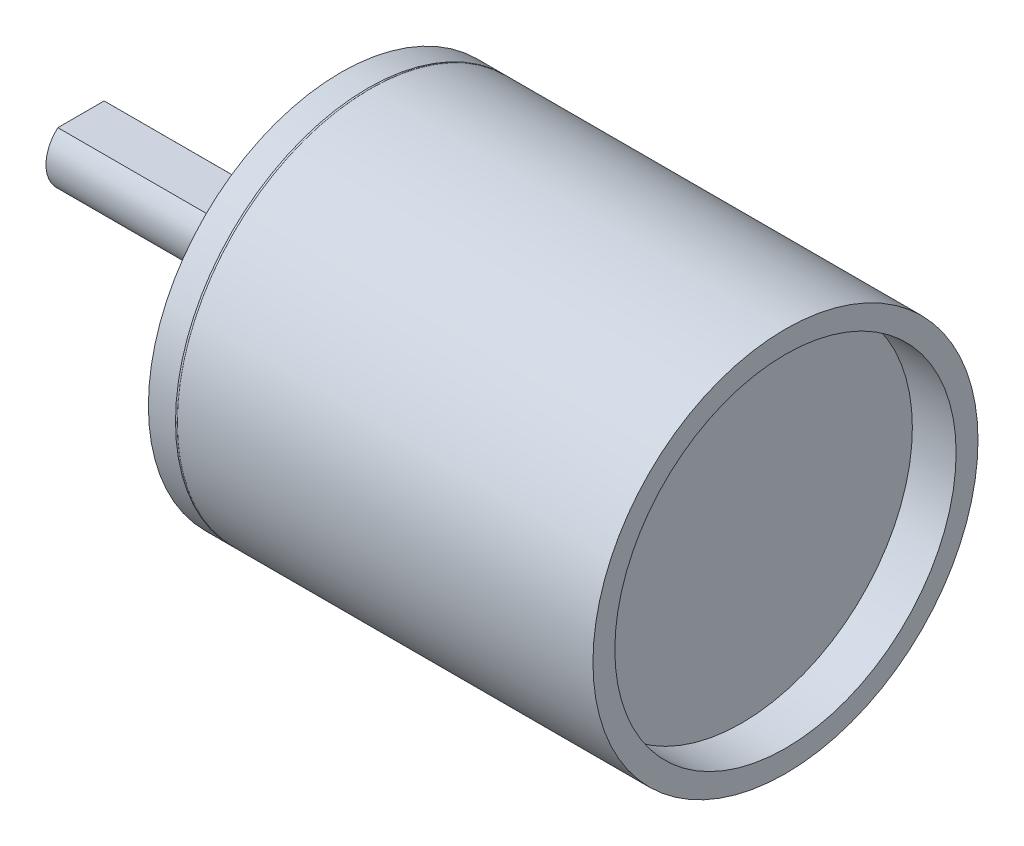
ISO-10303-21;
HEADER;
FILE_DESCRIPTION(('STEP AP214'),'2;1');
FILE_NAME('part.step','',(''),(''),'','','');
FILE_SCHEMA(('AUTOMOTIVE_DESIGN { 1 0 10303 214 1 1 1 1 }'));
ENDSEC;
DATA;
#1=APPLICATION_CONTEXT('core data for automotive mechanical design processes');
#2=APPLICATION_PROTOCOL_DEFINITION('international standard','automotive_design',2000,#1);
#3=PRODUCT_CONTEXT('',#1,'mechanical');
#4=PRODUCT('Part','Part','',(#3));
#5=PRODUCT_RELATED_PRODUCT_CATEGORY('part','',(#4));
#6=PRODUCT_DEFINITION_FORMATION('','',#4);
#7=PRODUCT_DEFINITION_CONTEXT('part definition',#1,'design');
#8=PRODUCT_DEFINITION('design','',#6,#7);
#9=PRODUCT_DEFINITION_SHAPE('','',#8);
#10=(LENGTH_UNIT() NAMED_UNIT(*) SI_UNIT(.MILLI.,.METRE.));
#11=(NAMED_UNIT(*) PLANE_ANGLE_UNIT() SI_UNIT($,.RADIAN.));
#12=(NAMED_UNIT(*) SI_UNIT($,.STERADIAN.) SOLID_ANGLE_UNIT());
#13=UNCERTAINTY_MEASURE_WITH_UNIT(LENGTH_MEASURE(1.E-05),#10,'distance_accuracy_value','');
#14=(GEOMETRIC_REPRESENTATION_CONTEXT(3) GLOBAL_UNCERTAINTY_ASSIGNED_CONTEXT((#13)) GLOBAL_UNIT_ASSIGNED_CONTEXT((#10,
#11,#12)) REPRESENTATION_CONTEXT('',''));
#15=CARTESIAN_POINT('',(0.,0.,0.));
#16=DIRECTION('',(0.,0.,1.));
#17=DIRECTION('',(1.,0.,0.));
#18=AXIS2_PLACEMENT_3D('',#15,#16,#17);
#19=CARTESIAN_POINT('',(-5.304325681522,1.750000002747,0.));
#20=DIRECTION('',(0.713250449154662,-0.700909264299362,0.));
#21=DIRECTION('',(0.700909264299362,0.713250449154662,0.));
#22=AXIS2_PLACEMENT_3D('',#19,#20,#21);
#23=PLANE('',#22);
#24=DIRECTION('',(0.,0.,1.));
#25=VECTOR('',#24,1.);
#26=CARTESIAN_POINT('',(-5.55,1.5,0.));
#27=LINE('',#26,#25);
#28=CARTESIAN_POINT('',(-5.54999999999996,1.50000000000007,1.3228756555322));
#29=VERTEX_POINT('',#28);
#30=CARTESIAN_POINT('',(-5.54999999999996,1.50000000000007,-1.3228756555322));
#31=VERTEX_POINT('',#30);
#32=EDGE_CURVE('P0_E70',#29,#31,#27,.F.);
#33=ORIENTED_EDGE('',*,*,#32,.F.);
#34=CARTESIAN_POINT('',(-7.02404589467157,0.,0.));
#35=DIRECTION('',(0.713250449154662,-0.700909264299362,0.));
#36=DIRECTION('',(0.700909264299362,0.713250449154662,0.));
#37=AXIS2_PLACEMENT_3D('',#34,#35,#36);
#38=ELLIPSE('',#37,2.80406412974627,2.);
#39=EDGE_CURVE('P0_E19',#31,#29,#38,.T.);
#40=ORIENTED_EDGE('',*,*,#39,.F.);
#41=EDGE_LOOP('',(#33,#40));
#42=FACE_BOUND('',#41,.T.);
#43=ADVANCED_FACE('P0_F16',(#42),#23,.F.);
#44=CARTESIAN_POINT('',(-14.85,-0.25,1.684082062692E-07));
#45=DIRECTION('',(1.,0.,0.));
#46=DIRECTION('',(0.,0.,-1.));
#47=AXIS2_PLACEMENT_3D('',#44,#45,#46);
#48=PLANE('',#47);
#49=CARTESIAN_POINT('',(-14.85,0.,0.));
#50=DIRECTION('',(1.,0.,0.));
#51=DIRECTION('',(0.,0.,-1.));
#52=AXIS2_PLACEMENT_3D('',#49,#50,#51);
#53=CIRCLE('',#52,2.);
#54=CARTESIAN_POINT('',(-14.85,1.50000000000007,1.32287565553221));
#55=VERTEX_POINT('',#54);
#56=CARTESIAN_POINT('',(-14.85,1.50000000000007,-1.32287565553221));
#57=VERTEX_POINT('',#56);
#58=EDGE_CURVE('P0_E59',#55,#57,#53,.T.);
#59=ORIENTED_EDGE('',*,*,#58,.F.);
#60=DIRECTION('',(0.,0.,1.));
#61=VECTOR('',#60,1.);
#62=CARTESIAN_POINT('',(-14.85,1.5,0.));
#63=LINE('',#62,#61);
#64=EDGE_CURVE('P0_E62',#57,#55,#63,.T.);
#65=ORIENTED_EDGE('',*,*,#64,.F.);
#66=EDGE_LOOP('',(#59,#65));
#67=FACE_BOUND('',#66,.T.);
#68=ADVANCED_FACE('P0_F61',(#67),#48,.F.);
#69=CARTESIAN_POINT('',(-10.2,1.5,0.));
#70=DIRECTION('',(0.,1.,0.));
#71=DIRECTION('',(0.,0.,1.));
#72=AXIS2_PLACEMENT_3D('',#69,#70,#71);
#73=PLANE('',#72);
#74=ORIENTED_EDGE('',*,*,#64,.T.);
#75=DIRECTION('',(1.,0.,0.));
#76=VECTOR('',#75,1.);
#77=CARTESIAN_POINT('',(-14.85,1.50000000000015,1.32287565553213));
#78=LINE('',#77,#76);
#79=EDGE_CURVE('P0_E69',#29,#55,#78,.F.);
#80=ORIENTED_EDGE('',*,*,#79,.F.);
#81=ORIENTED_EDGE('',*,*,#32,.T.);
#82=DIRECTION('',(1.,0.,0.));
#83=VECTOR('',#82,1.);
#84=CARTESIAN_POINT('',(-14.85,1.50000000000015,-1.32287565553213));
#85=LINE('',#84,#83);
#86=EDGE_CURVE('P0_E64',#57,#31,#85,.T.);
#87=ORIENTED_EDGE('',*,*,#86,.F.);
#88=EDGE_LOOP('',(#74,#80,#81,#87));
#89=FACE_BOUND('',#88,.T.);
#90=ADVANCED_FACE('P0_F67',(#89),#73,.T.);
#91=CARTESIAN_POINT('',(-14.85,0.,0.));
#92=DIRECTION('',(1.,0.,0.));
#93=DIRECTION('',(0.,0.,-1.));
#94=AXIS2_PLACEMENT_3D('',#91,#92,#93);
#95=CYLINDRICAL_SURFACE('',#94,2.);
#96=CARTESIAN_POINT('',(-3.15,0.,0.));
#97=DIRECTION('',(1.,0.,0.));
#98=DIRECTION('',(0.,0.,-1.));
#99=AXIS2_PLACEMENT_3D('',#96,#97,#98);
#100=CIRCLE('',#99,2.);
#101=CARTESIAN_POINT('',(-3.15,0.,-2.));
#102=VERTEX_POINT('',#101);
#103=EDGE_CURVE('P0_E114',#102,#102,#100,.F.);
#104=ORIENTED_EDGE('',*,*,#103,.T.);
#105=EDGE_LOOP('',(#104));
#106=FACE_BOUND('',#105,.T.);
#107=ORIENTED_EDGE('',*,*,#58,.T.);
#108=ORIENTED_EDGE('',*,*,#86,.T.);
#109=ORIENTED_EDGE('',*,*,#39,.T.);
#110=ORIENTED_EDGE('',*,*,#79,.T.);
#111=EDGE_LOOP('',(#107,#108,#109,#110));
#112=FACE_BOUND('',#111,.T.);
#113=ADVANCED_FACE('P0_F72',(#106,#112),#95,.T.);
#114=CARTESIAN_POINT('',(-3.15,0.,0.));
#115=DIRECTION('',(1.,0.,0.));
#116=DIRECTION('',(0.,0.,-1.));
#117=AXIS2_PLACEMENT_3D('',#114,#115,#116);
#118=PLANE('',#117);
#119=ORIENTED_EDGE('',*,*,#103,.F.);
#120=EDGE_LOOP('',(#119));
#121=FACE_BOUND('',#120,.T.);
#122=CARTESIAN_POINT('',(-3.15,0.,0.));
#123=DIRECTION('',(1.,0.,0.));
#124=DIRECTION('',(0.,0.,-1.));
#125=AXIS2_PLACEMENT_3D('',#122,#123,#124);
#126=CIRCLE('',#125,3.5);
#127=CARTESIAN_POINT('',(-3.15,0.,-3.5));
#128=VERTEX_POINT('',#127);
#129=EDGE_CURVE('P0_E111',#128,#128,#126,.T.);
#130=ORIENTED_EDGE('',*,*,#129,.F.);
#131=EDGE_LOOP('',(#130));
#132=FACE_BOUND('',#131,.T.);
#133=ADVANCED_FACE('P0_F119',(#121,#132),#118,.F.);
#134=CARTESIAN_POINT('',(-3.15,0.,0.));
#135=DIRECTION('',(1.,0.,0.));
#136=DIRECTION('',(0.,0.,-1.));
#137=AXIS2_PLACEMENT_3D('',#134,#135,#136);
#138=CYLINDRICAL_SURFACE('',#137,3.5);
#139=ORIENTED_EDGE('',*,*,#129,.T.);
#140=EDGE_LOOP('',(#139));
#141=FACE_BOUND('',#140,.T.);
#142=CARTESIAN_POINT('',(-1.35,0.,0.));
#143=DIRECTION('',(1.,0.,0.));
#144=DIRECTION('',(0.,0.,-1.));
#145=AXIS2_PLACEMENT_3D('',#142,#143,#144);
#146=CIRCLE('',#145,3.5);
#147=CARTESIAN_POINT('',(-1.35,0.,-3.5));
#148=VERTEX_POINT('',#147);
#149=EDGE_CURVE('P0_E108',#148,#148,#146,.F.);
#150=ORIENTED_EDGE('',*,*,#149,.T.);
#151=EDGE_LOOP('',(#150));
#152=FACE_BOUND('',#151,.T.);
#153=ADVANCED_FACE('P0_F122',(#141,#152),#138,.T.);
#154=CARTESIAN_POINT('',(-1.35,0.,0.));
#155=DIRECTION('',(1.,0.,0.));
#156=DIRECTION('',(0.,0.,-1.));
#157=AXIS2_PLACEMENT_3D('',#154,#155,#156);
#158=PLANE('',#157);
#159=ORIENTED_EDGE('',*,*,#149,.F.);
#160=EDGE_LOOP('',(#159));
#161=FACE_BOUND('',#160,.T.);
#162=CARTESIAN_POINT('',(-1.35,0.,0.));
#163=DIRECTION('',(1.,0.,0.));
#164=DIRECTION('',(0.,0.,-1.));
#165=AXIS2_PLACEMENT_3D('',#162,#163,#164);
#166=CIRCLE('',#165,5.);
#167=CARTESIAN_POINT('',(-1.35,0.,-5.));
#168=VERTEX_POINT('',#167);
#169=EDGE_CURVE('P0_E103',#168,#168,#166,.T.);
#170=ORIENTED_EDGE('',*,*,#169,.F.);
#171=EDGE_LOOP('',(#170));
#172=FACE_BOUND('',#171,.T.);
#173=ADVANCED_FACE('P0_F128',(#161,#172),#158,.F.);
#174=CARTESIAN_POINT('',(4.0000000000191,6.999999999989,1.221730476395E-05));
#175=DIRECTION('',(-1.,0.,0.));
#176=DIRECTION('',(0.,0.,1.));
#177=AXIS2_PLACEMENT_3D('',#174,#175,#176);
#178=CONICAL_SURFACE('',#177,1.02499999981555,1.02974425851489);
#179=CARTESIAN_POINT('',(4.,6.999999999989,1.221730476395E-05));
#180=DIRECTION('',(-1.,0.,0.));
#181=DIRECTION('',(0.,0.,1.));
#182=AXIS2_PLACEMENT_3D('',#179,#180,#181);
#183=CIRCLE('',#182,1.025);
#184=CARTESIAN_POINT('',(4.,6.999999999989,1.02501221730476));
#185=VERTEX_POINT('',#184);
#186=EDGE_CURVE('P0_E106',#185,#185,#183,.T.);
#187=ORIENTED_EDGE('',*,*,#186,.T.);
#188=EDGE_LOOP('',(#187));
#189=FACE_BOUND('',#188,.T.);
#190=CARTESIAN_POINT('',(4.61588213448749,7.00000000006185,1.221730476395E-05));
#191=VERTEX_POINT('',#190);
#192=VERTEX_LOOP('',#191);
#193=FACE_BOUND('',#192,.T.);
#194=ADVANCED_FACE('P0_F134',(#189,#193),#178,.F.);
#195=CARTESIAN_POINT('',(3.99999999996226,-3.500010580491,6.062171717829));
#196=DIRECTION('',(-1.,0.,0.));
#197=DIRECTION('',(0.,0.,1.));
#198=AXIS2_PLACEMENT_3D('',#195,#196,#197);
#199=CONICAL_SURFACE('',#198,1.02499999994784,1.02974425865799);
#200=CARTESIAN_POINT('',(3.99999999990541,-2.98751058050285,5.17449567897052));
#201=CARTESIAN_POINT('',(4.02566175549754,-3.00886473888174,5.21148218541788));
#202=CARTESIAN_POINT('',(4.05132351111989,-3.03021889832285,5.24846869123101));
#203=CARTESIAN_POINT('',(4.1026470223646,-3.07292721927441,5.32244170162462));
#204=CARTESIAN_POINT('',(4.12830877798695,-3.09428138078487,5.35942820620511));
#205=CARTESIAN_POINT('',(4.17963228919821,-3.13698970584252,5.43340121420825));
#206=CARTESIAN_POINT('',(4.20529404478713,-3.15834386938971,5.47038771763089));
#207=CARTESIAN_POINT('',(4.25661755597447,-3.20105219856139,5.54436072327025));
#208=CARTESIAN_POINT('',(4.2822793115729,-3.22240636418587,5.58134722548696));
#209=CARTESIAN_POINT('',(4.33360282277961,-3.26511469751708,5.65532022875441));
#210=CARTESIAN_POINT('',(4.35926457838788,-3.2864688652238,5.69230672980515));
#211=CARTESIAN_POINT('',(4.41058808962184,-3.32917720272132,5.76627973065341));
#212=CARTESIAN_POINT('',(4.43624984524753,-3.35053137251211,5.80326623045093));
#213=CARTESIAN_POINT('',(4.48757335646287,-3.39323971412742,5.87723922889167));
#214=CARTESIAN_POINT('',(4.51323511205252,-3.41459388595195,5.91422572753488));
#215=CARTESIAN_POINT('',(4.56455862325077,-3.45730223168929,5.98819872364552));
#216=CARTESIAN_POINT('',(4.59022037885936,-3.4786564056021,6.02518522111294));
#217=CARTESIAN_POINT('',(4.61588213448749,-3.50001058057184,6.0621717179566));
#218=B_SPLINE_CURVE_WITH_KNOTS('',3,(#200,#201,#202,#203,#204,#205,#206,#207,#208,#209,#210,
#211,#212,#213,#214,#215,#216,#217),.UNSPECIFIED.,.F.,.F.,(4,2,2,2,2,2,2,2,4),(0.,
0.149474904093955,0.298949808103517,0.448424712101636,0.597899616099755,0.747374520193708,
0.896849424203269,1.04632432820139,1.19579923229534),.UNSPECIFIED.);
#219=CARTESIAN_POINT('',(3.99999999997635,-2.98751058049379,5.17449567895433));
#220=VERTEX_POINT('',#219);
#221=CARTESIAN_POINT('',(4.61588213448749,-3.500010580491,6.062171717829));
#222=VERTEX_POINT('',#221);
#223=EDGE_CURVE('P0_E107',#220,#222,#218,.T.);
#224=ORIENTED_EDGE('',*,*,#223,.T.);
#225=DIRECTION('',(0.515038074909772,0.428583650350787,-0.742328657701715));
#226=VECTOR('',#225,1.);
#227=CARTESIAN_POINT('',(-346204.404158143,-288097.784339413,499000.));
#228=LINE('',#227,#226);
#229=CARTESIAN_POINT('',(3.99999999999056,-4.01251058047455,6.94984775668915));
#230=VERTEX_POINT('',#229);
#231=EDGE_CURVE('P0_E34',#222,#230,#228,.F.);
#232=ORIENTED_EDGE('',*,*,#231,.T.);
#233=CARTESIAN_POINT('',(4.,-3.500010580491,6.062171717829));
#234=DIRECTION('',(-1.,0.,0.));
#235=DIRECTION('',(0.,0.,1.));
#236=AXIS2_PLACEMENT_3D('',#233,#234,#235);
#237=CIRCLE('',#236,1.025000000001);
#238=EDGE_CURVE('P0_E169',#230,#220,#237,.T.);
#239=ORIENTED_EDGE('',*,*,#238,.T.);
#240=EDGE_LOOP('',(#224,#232,#239));
#241=FACE_BOUND('',#240,.T.);
#242=ADVANCED_FACE('P0_F250',(#241),#199,.F.);
#243=CARTESIAN_POINT('',(3.99999999996226,-3.500010580491,6.062171717829));
#244=DIRECTION('',(-1.,0.,0.));
#245=DIRECTION('',(0.,0.,1.));
#246=AXIS2_PLACEMENT_3D('',#243,#244,#245);
#247=CONICAL_SURFACE('',#246,1.02499999989861,1.02974425855217);
#248=CARTESIAN_POINT('',(4.,-3.500010580491,6.062171717829));
#249=DIRECTION('',(-1.,0.,0.));
#250=DIRECTION('',(0.,0.,1.));
#251=AXIS2_PLACEMENT_3D('',#248,#249,#250);
#252=CIRCLE('',#251,1.025000000001);
#253=EDGE_CURVE('P0_E168',#220,#230,#252,.T.);
#254=ORIENTED_EDGE('',*,*,#253,.T.);
#255=ORIENTED_EDGE('',*,*,#231,.F.);
#256=ORIENTED_EDGE('',*,*,#223,.F.);
#257=EDGE_LOOP('',(#254,#255,#256));
#258=FACE_BOUND('',#257,.T.);
#259=ADVANCED_FACE('P0_F183',(#258),#247,.F.);
#260=CARTESIAN_POINT('',(3.99999999996226,-3.499989419498,-6.062183935134));
#261=DIRECTION('',(-1.,0.,0.));
#262=DIRECTION('',(0.,0.,1.));
#263=AXIS2_PLACEMENT_3D('',#260,#261,#262);
#264=CONICAL_SURFACE('',#263,1.02500000002402,1.02974425869443);
#265=CARTESIAN_POINT('',(4.,-3.499989419498,-6.062183935134));
#266=DIRECTION('',(-1.,0.,0.));
#267=DIRECTION('',(0.,0.,1.));
#268=AXIS2_PLACEMENT_3D('',#265,#266,#267);
#269=CIRCLE('',#268,1.025);
#270=CARTESIAN_POINT('',(4.,-3.499989419498,-5.037183935134));
#271=VERTEX_POINT('',#270);
#272=EDGE_CURVE('P0_E102',#271,#271,#269,.T.);
#273=ORIENTED_EDGE('',*,*,#272,.T.);
#274=EDGE_LOOP('',(#273));
#275=FACE_BOUND('',#274,.T.);
#276=CARTESIAN_POINT('',(4.61588213443065,-3.499989419498,-6.062183935134));
#277=VERTEX_POINT('',#276);
#278=VERTEX_LOOP('',#277);
#279=FACE_BOUND('',#278,.T.);
#280=ADVANCED_FACE('P0_F142',(#275,#279),#264,.F.);
#281=CARTESIAN_POINT('',(-1.35,0.,0.));
#282=DIRECTION('',(1.,0.,0.));
#283=DIRECTION('',(0.,0.,-1.));
#284=AXIS2_PLACEMENT_3D('',#281,#282,#283);
#285=CYLINDRICAL_SURFACE('',#284,5.);
#286=ORIENTED_EDGE('',*,*,#169,.T.);
#287=EDGE_LOOP('',(#286));
#288=FACE_BOUND('',#287,.T.);
#289=CARTESIAN_POINT('',(0.,0.,0.));
#290=DIRECTION('',(1.,0.,0.));
#291=DIRECTION('',(0.,0.,-1.));
#292=AXIS2_PLACEMENT_3D('',#289,#290,#291);
#293=CIRCLE('',#292,5.);
#294=CARTESIAN_POINT('',(0.,0.,-5.));
#295=VERTEX_POINT('',#294);
#296=EDGE_CURVE('P0_E99',#295,#295,#293,.F.);
#297=ORIENTED_EDGE('',*,*,#296,.T.);
#298=EDGE_LOOP('',(#297));
#299=FACE_BOUND('',#298,.T.);
#300=ADVANCED_FACE('P0_F138',(#288,#299),#285,.T.);
#301=CARTESIAN_POINT('',(4.,6.999999999989,1.221730476395E-05));
#302=DIRECTION('',(-1.,0.,0.));
#303=DIRECTION('',(0.,0.,1.));
#304=AXIS2_PLACEMENT_3D('',#301,#302,#303);
#305=CYLINDRICAL_SURFACE('',#304,1.025);
#306=ORIENTED_EDGE('',*,*,#186,.F.);
#307=EDGE_LOOP('',(#306));
#308=FACE_BOUND('',#307,.T.);
#309=CARTESIAN_POINT('',(0.,6.999999999989,1.221730476395E-05));
#310=DIRECTION('',(-1.,0.,0.));
#311=DIRECTION('',(0.,0.,1.));
#312=AXIS2_PLACEMENT_3D('',#309,#310,#311);
#313=CIRCLE('',#312,1.025);
#314=CARTESIAN_POINT('',(0.,6.999999999989,1.02501221730476));
#315=VERTEX_POINT('',#314);
#316=EDGE_CURVE('P0_E96',#315,#315,#313,.T.);
#317=ORIENTED_EDGE('',*,*,#316,.T.);
#318=EDGE_LOOP('',(#317));
#319=FACE_BOUND('',#318,.T.);
#320=ADVANCED_FACE('P0_F141',(#308,#319),#305,.F.);
#321=CARTESIAN_POINT('',(4.,-3.500010580491,6.062171717829));
#322=DIRECTION('',(-1.,0.,0.));
#323=DIRECTION('',(0.,0.,1.));
#324=AXIS2_PLACEMENT_3D('',#321,#322,#323);
#325=CYLINDRICAL_SURFACE('',#324,1.025000000001);
#326=ORIENTED_EDGE('',*,*,#253,.F.);
#327=ORIENTED_EDGE('',*,*,#238,.F.);
#328=EDGE_LOOP('',(#326,#327));
#329=FACE_BOUND('',#328,.T.);
#330=CARTESIAN_POINT('',(0.,-3.500010580491,6.062171717829));
#331=DIRECTION('',(-1.,0.,0.));
#332=DIRECTION('',(0.,0.,1.));
#333=AXIS2_PLACEMENT_3D('',#330,#331,#332);
#334=CIRCLE('',#333,1.025000000001);
#335=CARTESIAN_POINT('',(0.,-3.500010580491,7.08717171783));
#336=VERTEX_POINT('',#335);
#337=EDGE_CURVE('P0_E93',#336,#336,#334,.T.);
#338=ORIENTED_EDGE('',*,*,#337,.T.);
#339=EDGE_LOOP('',(#338));
#340=FACE_BOUND('',#339,.T.);
#341=ADVANCED_FACE('P0_F201',(#329,#340),#325,.F.);
#342=CARTESIAN_POINT('',(4.,-3.499989419498,-6.062183935134));
#343=DIRECTION('',(-1.,0.,0.));
#344=DIRECTION('',(0.,0.,1.));
#345=AXIS2_PLACEMENT_3D('',#342,#343,#344);
#346=CYLINDRICAL_SURFACE('',#345,1.025);
#347=ORIENTED_EDGE('',*,*,#272,.F.);
#348=EDGE_LOOP('',(#347));
#349=FACE_BOUND('',#348,.T.);
#350=CARTESIAN_POINT('',(0.,-3.499989419498,-6.062183935134));
#351=DIRECTION('',(-1.,0.,0.));
#352=DIRECTION('',(0.,0.,1.));
#353=AXIS2_PLACEMENT_3D('',#350,#351,#352);
#354=CIRCLE('',#353,1.025);
#355=CARTESIAN_POINT('',(0.,-3.499989419498,-5.037183935134));
#356=VERTEX_POINT('',#355);
#357=EDGE_CURVE('P0_E90',#356,#356,#354,.T.);
#358=ORIENTED_EDGE('',*,*,#357,.T.);
#359=EDGE_LOOP('',(#358));
#360=FACE_BOUND('',#359,.T.);
#361=ADVANCED_FACE('P0_F209',(#349,#360),#346,.F.);
#362=CARTESIAN_POINT('',(22.9,0.,0.));
#363=DIRECTION('',(1.,0.,0.));
#364=DIRECTION('',(0.,0.,-1.));
#365=AXIS2_PLACEMENT_3D('',#362,#363,#364);
#366=PLANE('',#365);
#367=CARTESIAN_POINT('',(22.9,0.,0.));
#368=DIRECTION('',(1.,0.,0.));
#369=DIRECTION('',(0.,0.,-1.));
#370=AXIS2_PLACEMENT_3D('',#367,#368,#369);
#371=CIRCLE('',#370,9.75);
#372=CARTESIAN_POINT('',(22.9,0.,-9.75));
#373=VERTEX_POINT('',#372);
#374=EDGE_CURVE('P0_E87',#373,#373,#371,.T.);
#375=ORIENTED_EDGE('',*,*,#374,.T.);
#376=EDGE_LOOP('',(#375));
#377=FACE_BOUND('',#376,.T.);
#378=ADVANCED_FACE('P0_F150',(#377),#366,.T.);
#379=CARTESIAN_POINT('',(0.,0.,0.));
#380=DIRECTION('',(1.,0.,0.));
#381=DIRECTION('',(0.,0.,-1.));
#382=AXIS2_PLACEMENT_3D('',#379,#380,#381);
#383=PLANE('',#382);
#384=ORIENTED_EDGE('',*,*,#357,.F.);
#385=EDGE_LOOP('',(#384));
#386=FACE_BOUND('',#385,.T.);
#387=ORIENTED_EDGE('',*,*,#337,.F.);
#388=EDGE_LOOP('',(#387));
#389=FACE_BOUND('',#388,.T.);
#390=ORIENTED_EDGE('',*,*,#316,.F.);
#391=EDGE_LOOP('',(#390));
#392=FACE_BOUND('',#391,.T.);
#393=ORIENTED_EDGE('',*,*,#296,.F.);
#394=EDGE_LOOP('',(#393));
#395=FACE_BOUND('',#394,.T.);
#396=CARTESIAN_POINT('',(0.,0.,0.));
#397=DIRECTION('',(1.,0.,0.));
#398=DIRECTION('',(0.,0.,-1.));
#399=AXIS2_PLACEMENT_3D('',#396,#397,#398);
#400=CIRCLE('',#399,11.);
#401=CARTESIAN_POINT('',(0.,0.,-11.));
#402=VERTEX_POINT('',#401);
#403=EDGE_CURVE('P0_E84',#402,#402,#400,.T.);
#404=ORIENTED_EDGE('',*,*,#403,.F.);
#405=EDGE_LOOP('',(#404));
#406=FACE_BOUND('',#405,.T.);
#407=ADVANCED_FACE('P0_F146',(#386,#389,#392,#395,#406),#383,.F.);
#408=CARTESIAN_POINT('',(22.9,0.,0.));
#409=DIRECTION('',(1.,0.,0.));
#410=DIRECTION('',(0.,0.,-1.));
#411=AXIS2_PLACEMENT_3D('',#408,#409,#410);
#412=CYLINDRICAL_SURFACE('',#411,9.75);
#413=ORIENTED_EDGE('',*,*,#374,.F.);
#414=EDGE_LOOP('',(#413));
#415=FACE_BOUND('',#414,.T.);
#416=CARTESIAN_POINT('',(25.4,0.,0.));
#417=DIRECTION('',(1.,0.,0.));
#418=DIRECTION('',(0.,0.,-1.));
#419=AXIS2_PLACEMENT_3D('',#416,#417,#418);
#420=CIRCLE('',#419,9.75);
#421=CARTESIAN_POINT('',(25.4,0.,-9.75));
#422=VERTEX_POINT('',#421);
#423=EDGE_CURVE('P0_E81',#422,#422,#420,.F.);
#424=ORIENTED_EDGE('',*,*,#423,.F.);
#425=EDGE_LOOP('',(#424));
#426=FACE_BOUND('',#425,.T.);
#427=ADVANCED_FACE('P0_F149',(#415,#426),#412,.F.);
#428=CARTESIAN_POINT('',(0.,0.,0.));
#429=DIRECTION('',(1.,0.,0.));
#430=DIRECTION('',(0.,0.,-1.));
#431=AXIS2_PLACEMENT_3D('',#428,#429,#430);
#432=CYLINDRICAL_SURFACE('',#431,11.);
#433=ORIENTED_EDGE('',*,*,#403,.T.);
#434=EDGE_LOOP('',(#433));
#435=FACE_BOUND('',#434,.T.);
#436=CARTESIAN_POINT('',(1.55000000000067,0.,0.));
#437=DIRECTION('',(1.,0.,0.));
#438=DIRECTION('',(0.,-1.,0.));
#439=AXIS2_PLACEMENT_3D('',#436,#437,#438);
#440=CIRCLE('',#439,11.0000000000012);
#441=CARTESIAN_POINT('',(1.55000000000067,-11.0000000000012,0.));
#442=VERTEX_POINT('',#441);
#443=EDGE_CURVE('P0_E80',#442,#442,#440,.F.);
#444=ORIENTED_EDGE('',*,*,#443,.T.);
#445=EDGE_LOOP('',(#444));
#446=FACE_BOUND('',#445,.T.);
#447=ADVANCED_FACE('P0_F155',(#435,#446),#432,.T.);
#448=CARTESIAN_POINT('',(25.4,0.,0.));
#449=DIRECTION('',(1.,0.,0.));
#450=DIRECTION('',(0.,0.,-1.));
#451=AXIS2_PLACEMENT_3D('',#448,#449,#450);
#452=PLANE('',#451);
#453=ORIENTED_EDGE('',*,*,#423,.T.);
#454=EDGE_LOOP('',(#453));
#455=FACE_BOUND('',#454,.T.);
#456=CARTESIAN_POINT('',(25.4,0.,0.));
#457=DIRECTION('',(1.,0.,0.));
#458=DIRECTION('',(0.,0.,-1.));
#459=AXIS2_PLACEMENT_3D('',#456,#457,#458);
#460=CIRCLE('',#459,11.);
#461=CARTESIAN_POINT('',(25.4,0.,-11.));
#462=VERTEX_POINT('',#461);
#463=EDGE_CURVE('P0_E25',#462,#462,#460,.F.);
#464=ORIENTED_EDGE('',*,*,#463,.F.);
#465=EDGE_LOOP('',(#464));
#466=FACE_BOUND('',#465,.T.);
#467=ADVANCED_FACE('P0_F158',(#455,#466),#452,.T.);
#468=CARTESIAN_POINT('',(1.6,0.,0.));
#469=DIRECTION('',(1.,0.,0.));
#470=DIRECTION('',(0.,-1.,0.));
#471=AXIS2_PLACEMENT_3D('',#468,#469,#470);
#472=TOROIDAL_SURFACE('',#471,11.08660254038,0.1);
#473=ORIENTED_EDGE('',*,*,#443,.F.);
#474=EDGE_LOOP('',(#473));
#475=FACE_BOUND('',#474,.T.);
#476=CARTESIAN_POINT('',(1.65,0.,0.));
#477=DIRECTION('',(1.,0.,0.));
#478=DIRECTION('',(0.,0.,-1.));
#479=AXIS2_PLACEMENT_3D('',#476,#477,#478);
#480=CIRCLE('',#479,11.);
#481=CARTESIAN_POINT('',(1.65,0.,-11.));
#482=VERTEX_POINT('',#481);
#483=EDGE_CURVE('P0_E11',#482,#482,#480,.T.);
#484=ORIENTED_EDGE('',*,*,#483,.F.);
#485=EDGE_LOOP('',(#484));
#486=FACE_BOUND('',#485,.T.);
#487=ADVANCED_FACE('P0_F214',(#475,#486),#472,.F.);
#488=CARTESIAN_POINT('',(0.,0.,0.));
#489=DIRECTION('',(1.,0.,0.));
#490=DIRECTION('',(0.,0.,-1.));
#491=AXIS2_PLACEMENT_3D('',#488,#489,#490);
#492=CYLINDRICAL_SURFACE('',#491,11.);
#493=ORIENTED_EDGE('',*,*,#463,.T.);
#494=EDGE_LOOP('',(#493));
#495=FACE_BOUND('',#494,.T.);
#496=ORIENTED_EDGE('',*,*,#483,.T.);
#497=EDGE_LOOP('',(#496));
#498=FACE_BOUND('',#497,.T.);
#499=ADVANCED_FACE('P0_F212',(#495,#498),#492,.T.);
#500=CLOSED_SHELL('',(#43,#68,#90,#113,#133,#153,#173,#194,#242,#259,#280,#300,#320,#341,#361,
#378,#407,#427,#447,#467,#487,#499));
#501=MANIFOLD_SOLID_BREP('P0_B1',#500);
#502=CARTESIAN_POINT('',(3.9,6.999999999989,1.221730476395E-05));
#503=DIRECTION('',(-1.,0.,0.));
#504=DIRECTION('',(0.,0.,1.));
#505=AXIS2_PLACEMENT_3D('',#502,#503,#504);
#506=CYLINDRICAL_SURFACE('',#505,1.25);
#507=CARTESIAN_POINT('',(3.9,6.999999999989,1.221730476395E-05));
#508=DIRECTION('',(-1.,0.,0.));
#509=DIRECTION('',(0.,0.,1.));
#510=AXIS2_PLACEMENT_3D('',#507,#508,#509);
#511=CIRCLE('',#510,1.25);
#512=CARTESIAN_POINT('',(3.9,6.999999999989,1.25001221730476));
#513=VERTEX_POINT('',#512);
#514=EDGE_CURVE('P1_E11',#513,#513,#511,.T.);
#515=ORIENTED_EDGE('',*,*,#514,.T.);
#516=EDGE_LOOP('',(#515));
#517=FACE_BOUND('',#516,.T.);
#518=CARTESIAN_POINT('',(0.,6.999999999989,1.221730476395E-05));
#519=DIRECTION('',(-1.,0.,0.));
#520=DIRECTION('',(0.,0.,1.));
#521=AXIS2_PLACEMENT_3D('',#518,#519,#520);
#522=CIRCLE('',#521,1.25);
#523=CARTESIAN_POINT('',(0.,6.999999999989,1.25001221730476));
#524=VERTEX_POINT('',#523);
#525=EDGE_CURVE('P1_E23',#524,#524,#522,.F.);
#526=ORIENTED_EDGE('',*,*,#525,.T.);
#527=EDGE_LOOP('',(#526));
#528=FACE_BOUND('',#527,.T.);
#529=ADVANCED_FACE('P1_F16',(#517,#528),#506,.T.);
#530=CARTESIAN_POINT('',(3.9,6.999999999989,1.221730476364E-05));
#531=DIRECTION('',(1.,0.,0.));
#532=DIRECTION('',(0.,0.,-1.));
#533=AXIS2_PLACEMENT_3D('',#530,#531,#532);
#534=PLANE('',#533);
#535=CARTESIAN_POINT('',(3.9,8.024999999989,1.221730476386E-05));
#536=CARTESIAN_POINT('',(3.9,8.02385783770784,-0.20658324030408));
#537=CARTESIAN_POINT('',(3.9,7.94663980673409,-0.39289793221752));
#538=CARTESIAN_POINT('',(3.9,7.86879966045055,-0.58071368833601));
#539=CARTESIAN_POINT('',(3.9,7.72429001920784,-0.725261430728882));
#540=CARTESIAN_POINT('',(3.9,7.58176906531624,-0.867819961436941));
#541=CARTESIAN_POINT('',(3.9,7.39418807755779,-0.94609873393043));
#542=CARTESIAN_POINT('',(3.9,7.20735483346087,-1.02406546810562));
#543=CARTESIAN_POINT('',(3.9,7.0040325312465,-1.02497391422067));
#544=CARTESIAN_POINT('',(3.9,6.80191499624577,-1.02587697742355));
#545=CARTESIAN_POINT('',(3.9,6.61353792290775,-0.949297888895742));
#546=CARTESIAN_POINT('',(3.9,6.42535409452807,-0.872797358350123));
#547=CARTESIAN_POINT('',(3.9,6.28018718094833,-0.72970396264077));
#548=CARTESIAN_POINT('',(3.9,6.13391281017504,-0.58551892830303));
#549=CARTESIAN_POINT('',(3.9,6.05421373235404,-0.394861817230703));
#550=CARTESIAN_POINT('',(3.9,5.97586390194588,-0.2074323923611));
#551=CARTESIAN_POINT('',(3.9,5.974999999989,1.221730476386E-05));
#552=B_SPLINE_CURVE_WITH_KNOTS('',2,(#535,#536,#537,#538,#539,#540,#541,#542,#543,#544,#545,
#546,#547,#548,#549,#550,#551),.UNSPECIFIED.,.F.,.F.,(3,2,2,2,2,2,2,2,3),(0.,0.125,0.25,0.375,
0.5,0.625,0.75,0.875,1.),.UNSPECIFIED.);
#553=CARTESIAN_POINT('',(3.9,8.024999999989,1.221730476386E-05));
#554=VERTEX_POINT('',#553);
#555=CARTESIAN_POINT('',(3.9,5.974999999989,1.221730476386E-05));
#556=VERTEX_POINT('',#555);
#557=EDGE_CURVE('P1_E29',#554,#556,#552,.T.);
#558=ORIENTED_EDGE('',*,*,#557,.T.);
#559=CARTESIAN_POINT('',(3.9,5.974999999989,1.221730476386E-05));
#560=CARTESIAN_POINT('',(3.9,5.97614216227016,0.206607674912017));
#561=CARTESIAN_POINT('',(3.9,6.05336019324391,0.392922366827116));
#562=CARTESIAN_POINT('',(3.9,6.13120033952598,0.580738122943736));
#563=CARTESIAN_POINT('',(3.9,6.27570998077016,0.725285865338416));
#564=CARTESIAN_POINT('',(3.9,6.41823093466117,0.86784439604621));
#565=CARTESIAN_POINT('',(3.9,6.60581192242021,0.946123168540227));
#566=CARTESIAN_POINT('',(3.9,6.79264516651724,1.02408990271575));
#567=CARTESIAN_POINT('',(3.9,6.9959674687315,1.0249983488305));
#568=CARTESIAN_POINT('',(3.9,7.19808500373122,1.02590141203309));
#569=CARTESIAN_POINT('',(3.9,7.38646207707025,0.949322323505013));
#570=CARTESIAN_POINT('',(3.9,7.57464590545008,0.87282179295947));
#571=CARTESIAN_POINT('',(3.9,7.71981281902967,0.72972839725027));
#572=CARTESIAN_POINT('',(3.9,7.86608718980465,0.585543362910868));
#573=CARTESIAN_POINT('',(3.9,7.94578626762395,0.394886251840156));
#574=CARTESIAN_POINT('',(3.9,8.02413609803211,0.207456826968179));
#575=CARTESIAN_POINT('',(3.9,8.024999999989,1.221730476386E-05));
#576=B_SPLINE_CURVE_WITH_KNOTS('',2,(#559,#560,#561,#562,#563,#564,#565,#566,#567,#568,#569,
#570,#571,#572,#573,#574,#575),.UNSPECIFIED.,.F.,.F.,(3,2,2,2,2,2,2,2,3),(0.,0.125,0.25,0.375,
0.5,0.625,0.75,0.875,1.),.UNSPECIFIED.);
#577=EDGE_CURVE('P1_E32',#556,#554,#576,.T.);
#578=ORIENTED_EDGE('',*,*,#577,.T.);
#579=EDGE_LOOP('',(#558,#578));
#580=FACE_BOUND('',#579,.T.);
#581=ORIENTED_EDGE('',*,*,#514,.F.);
#582=EDGE_LOOP('',(#581));
#583=FACE_BOUND('',#582,.T.);
#584=ADVANCED_FACE('P1_F17',(#580,#583),#534,.T.);
#585=OPEN_SHELL('',(#529,#584));
#586=SHELL_BASED_SURFACE_MODEL('P1_B1',(#585));
#587=CARTESIAN_POINT('',(3.9,-3.499989419498,-6.062183935134));
#588=DIRECTION('',(-1.,0.,0.));
#589=DIRECTION('',(0.,0.,1.));
#590=AXIS2_PLACEMENT_3D('',#587,#588,#589);
#591=CYLINDRICAL_SURFACE('',#590,1.25);
#592=CARTESIAN_POINT('',(3.9,-3.499989419498,-6.062183935134));
#593=DIRECTION('',(-1.,0.,0.));
#594=DIRECTION('',(0.,0.,1.));
#595=AXIS2_PLACEMENT_3D('',#592,#593,#594);
#596=CIRCLE('',#595,1.25);
#597=CARTESIAN_POINT('',(3.9,-3.499989419498,-4.812183935134));
#598=VERTEX_POINT('',#597);
#599=EDGE_CURVE('P2_E11',#598,#598,#596,.T.);
#600=ORIENTED_EDGE('',*,*,#599,.T.);
#601=EDGE_LOOP('',(#600));
#602=FACE_BOUND('',#601,.T.);
#603=CARTESIAN_POINT('',(0.,-3.499989419498,-6.062183935134));
#604=DIRECTION('',(-1.,0.,0.));
#605=DIRECTION('',(0.,0.,1.));
#606=AXIS2_PLACEMENT_3D('',#603,#604,#605);
#607=CIRCLE('',#606,1.25);
#608=CARTESIAN_POINT('',(0.,-3.499989419498,-4.812183935134));
#609=VERTEX_POINT('',#608);
#610=EDGE_CURVE('P2_E23',#609,#609,#607,.F.);
#611=ORIENTED_EDGE('',*,*,#610,.T.);
#612=EDGE_LOOP('',(#611));
#613=FACE_BOUND('',#612,.T.);
#614=ADVANCED_FACE('P2_F16',(#602,#613),#591,.T.);
#615=CARTESIAN_POINT('',(3.9,-3.499989419498,-6.062183935134));
#616=DIRECTION('',(1.,0.,0.));
#617=DIRECTION('',(0.,0.,-1.));
#618=AXIS2_PLACEMENT_3D('',#615,#616,#617);
#619=PLANE('',#618);
#620=CARTESIAN_POINT('',(3.9,-4.012489419498,-6.949859974013));
#621=CARTESIAN_POINT('',(3.9,-4.19083525295183,-6.84557310365869));
#622=CARTESIAN_POINT('',(3.9,-4.31357949376138,-6.68554298124748));
#623=CARTESIAN_POINT('',(3.9,-4.43731263664949,-6.52422355907245));
#624=CARTESIAN_POINT('',(3.9,-4.49023983300017,-6.32680066746851));
#625=CARTESIAN_POINT('',(3.9,-4.54243866517341,-6.13209463547483));
#626=CARTESIAN_POINT('',(3.9,-4.51643957685048,-5.9305053485599));
#627=CARTESIAN_POINT('',(3.9,-4.490544127248,-5.72971964581279));
#628=CARTESIAN_POINT('',(3.9,-4.3896697135545,-5.55318314388166));
#629=CARTESIAN_POINT('',(3.9,-4.28939302173007,-5.3776926924209));
#630=CARTESIAN_POINT('',(3.9,-4.12888504899612,-5.25284290568188));
#631=CARTESIAN_POINT('',(3.9,-3.9685417319511,-5.12812119499601));
#632=CARTESIAN_POINT('',(3.9,-3.77203575936267,-5.07394965790216));
#633=CARTESIAN_POINT('',(3.9,-3.57403067139383,-5.01936485405938));
#634=CARTESIAN_POINT('',(3.9,-3.36906723088324,-5.04567198354395));
#635=CARTESIAN_POINT('',(3.9,-3.16757367232254,-5.07153375246312));
#636=CARTESIAN_POINT('',(3.9,-2.987489419498,-5.174507896255));
#637=B_SPLINE_CURVE_WITH_KNOTS('',2,(#620,#621,#622,#623,#624,#625,#626,#627,#628,#629,#630,
#631,#632,#633,#634,#635,#636),.UNSPECIFIED.,.F.,.F.,(3,2,2,2,2,2,2,2,3),(0.,0.125,0.25,0.375,
0.5,0.625,0.75,0.875,1.),.UNSPECIFIED.);
#638=CARTESIAN_POINT('',(3.9,-4.012489419498,-6.949859974013));
#639=VERTEX_POINT('',#638);
#640=CARTESIAN_POINT('',(3.9,-2.987489419498,-5.174507896255));
#641=VERTEX_POINT('',#640);
#642=EDGE_CURVE('P2_E29',#639,#641,#637,.T.);
#643=ORIENTED_EDGE('',*,*,#642,.T.);
#644=CARTESIAN_POINT('',(3.9,-2.987489419498,-5.174507896255));
#645=CARTESIAN_POINT('',(3.9,-2.80914358604476,-5.27879476660897));
#646=CARTESIAN_POINT('',(3.9,-2.68639934523462,-5.43882488902052));
#647=CARTESIAN_POINT('',(3.9,-2.56266620234675,-5.6001443111948));
#648=CARTESIAN_POINT('',(3.9,-2.50973900599583,-5.79756720279949));
#649=CARTESIAN_POINT('',(3.9,-2.45754017382256,-5.99227323479312));
#650=CARTESIAN_POINT('',(3.9,-2.48353926214552,-6.1938625217081));
#651=CARTESIAN_POINT('',(3.9,-2.50943471174809,-6.39464822445569));
#652=CARTESIAN_POINT('',(3.9,-2.6103091254415,-6.57118472638634));
#653=CARTESIAN_POINT('',(3.9,-2.71058581726644,-6.74667517784766));
#654=CARTESIAN_POINT('',(3.9,-2.87109378999988,-6.87152496458612));
#655=CARTESIAN_POINT('',(3.9,-3.03143710704519,-6.99624667527205));
#656=CARTESIAN_POINT('',(3.9,-3.22794307963333,-7.05041821236584));
#657=CARTESIAN_POINT('',(3.9,-3.42594816760257,-7.10500301620875));
#658=CARTESIAN_POINT('',(3.9,-3.63091160811276,-7.07869588672405));
#659=CARTESIAN_POINT('',(3.9,-3.83240516667386,-7.05283411780464));
#660=CARTESIAN_POINT('',(3.9,-4.012489419498,-6.949859974013));
#661=B_SPLINE_CURVE_WITH_KNOTS('',2,(#644,#645,#646,#647,#648,#649,#650,#651,#652,#653,#654,
#655,#656,#657,#658,#659,#660),.UNSPECIFIED.,.F.,.F.,(3,2,2,2,2,2,2,2,3),(0.,0.125,0.25,0.375,
0.5,0.625,0.75,0.875,1.),.UNSPECIFIED.);
#662=EDGE_CURVE('P2_E32',#641,#639,#661,.T.);
#663=ORIENTED_EDGE('',*,*,#662,.T.);
#664=EDGE_LOOP('',(#643,#663));
#665=FACE_BOUND('',#664,.T.);
#666=ORIENTED_EDGE('',*,*,#599,.F.);
#667=EDGE_LOOP('',(#666));
#668=FACE_BOUND('',#667,.T.);
#669=ADVANCED_FACE('P2_F17',(#665,#668),#619,.T.);
#670=OPEN_SHELL('',(#614,#669));
#671=SHELL_BASED_SURFACE_MODEL('P2_B1',(#670));
#672=CARTESIAN_POINT('',(3.9,-3.500010580491,6.062171717829));
#673=DIRECTION('',(-1.,0.,0.));
#674=DIRECTION('',(0.,0.,1.));
#675=AXIS2_PLACEMENT_3D('',#672,#673,#674);
#676=CYLINDRICAL_SURFACE('',#675,1.25);
#677=CARTESIAN_POINT('',(3.9,-3.500010580491,6.062171717829));
#678=DIRECTION('',(-1.,0.,0.));
#679=DIRECTION('',(0.,0.,1.));
#680=AXIS2_PLACEMENT_3D('',#677,#678,#679);
#681=CIRCLE('',#680,1.25);
#682=CARTESIAN_POINT('',(3.9,-3.500010580491,7.312171717829));
#683=VERTEX_POINT('',#682);
#684=EDGE_CURVE('P3_E10',#683,#683,#681,.T.);
#685=ORIENTED_EDGE('',*,*,#684,.T.);
#686=EDGE_LOOP('',(#685));
#687=FACE_BOUND('',#686,.T.);
#688=CARTESIAN_POINT('',(0.,-3.500010580491,6.062171717829));
#689=DIRECTION('',(-1.,0.,0.));
#690=DIRECTION('',(0.,0.,1.));
#691=AXIS2_PLACEMENT_3D('',#688,#689,#690);
#692=CIRCLE('',#691,1.25);
#693=CARTESIAN_POINT('',(0.,-3.500010580491,7.312171717829));
#694=VERTEX_POINT('',#693);
#695=EDGE_CURVE('P3_E22',#694,#694,#692,.F.);
#696=ORIENTED_EDGE('',*,*,#695,.T.);
#697=EDGE_LOOP('',(#696));
#698=FACE_BOUND('',#697,.T.);
#699=ADVANCED_FACE('P3_F15',(#687,#698),#676,.T.);
#700=CARTESIAN_POINT('',(3.9,-3.500010580491,6.062171717829));
#701=DIRECTION('',(1.,0.,0.));
#702=DIRECTION('',(0.,0.,-1.));
#703=AXIS2_PLACEMENT_3D('',#700,#701,#702);
#704=PLANE('',#703);
#705=CARTESIAN_POINT('',(3.9,-4.012510580491,6.949847756708));
#706=CARTESIAN_POINT('',(3.9,-3.83302258475706,7.0521563439599));
#707=CARTESIAN_POINT('',(3.9,-3.63306031297226,7.07844091346427));
#708=CARTESIAN_POINT('',(3.9,-3.43148702380251,7.10493724740826));
#709=CARTESIAN_POINT('',(3.9,-3.23405018620817,7.05206209819717));
#710=CARTESIAN_POINT('',(3.9,-3.0393304001439,6.99991459691044));
#711=CARTESIAN_POINT('',(3.9,-2.87774850070734,6.87660408249008));
#712=CARTESIAN_POINT('',(3.9,-2.71681070621193,6.75378511391683));
#713=CARTESIAN_POINT('',(3.9,-2.614362817692,6.578157058102));
#714=CARTESIAN_POINT('',(3.9,-2.51252197451694,6.40356966984268));
#715=CARTESIAN_POINT('',(3.9,-2.48465287391161,6.20214079457698));
#716=CARTESIAN_POINT('',(3.9,-2.45681236257715,6.00091855334506));
#717=CARTESIAN_POINT('',(3.9,-2.508151421585,5.80365362054217));
#718=CARTESIAN_POINT('',(3.9,-2.55988213877998,5.60488378236194));
#719=CARTESIAN_POINT('',(3.9,-2.68514650147075,5.44053380077434));
#720=CARTESIAN_POINT('',(3.9,-2.80829022962238,5.27896614482169));
#721=CARTESIAN_POINT('',(3.9,-2.987510580491,5.17449567895));
#722=B_SPLINE_CURVE_WITH_KNOTS('',2,(#705,#706,#707,#708,#709,#710,#711,#712,#713,#714,#715,
#716,#717,#718,#719,#720,#721),.UNSPECIFIED.,.F.,.F.,(3,2,2,2,2,2,2,2,3),(0.,0.125,0.25,0.375,
0.5,0.625,0.75,0.875,1.),.UNSPECIFIED.);
#723=CARTESIAN_POINT('',(3.9,-4.012510580491,6.949847756708));
#724=VERTEX_POINT('',#723);
#725=CARTESIAN_POINT('',(3.9,-2.987510580491,5.17449567895));
#726=VERTEX_POINT('',#725);
#727=EDGE_CURVE('P3_E28',#724,#726,#722,.T.);
#728=ORIENTED_EDGE('',*,*,#727,.T.);
#729=CARTESIAN_POINT('',(3.9,-2.987510580491,5.17449567895));
#730=CARTESIAN_POINT('',(3.9,-3.16699857622493,5.07218709169811));
#731=CARTESIAN_POINT('',(3.9,-3.36696084800974,5.04590252219372));
#732=CARTESIAN_POINT('',(3.9,-3.56853413717977,5.0194061882497));
#733=CARTESIAN_POINT('',(3.9,-3.76597097477383,5.07228133746099));
#734=CARTESIAN_POINT('',(3.9,-3.96069076083704,5.12442883874772));
#735=CARTESIAN_POINT('',(3.9,-4.12227266027466,5.2477393531684));
#736=CARTESIAN_POINT('',(3.9,-4.28321045476985,5.370558321741));
#737=CARTESIAN_POINT('',(3.9,-4.38565834329,5.546186377556));
#738=CARTESIAN_POINT('',(3.9,-4.48749918646432,5.72077376581386));
#739=CARTESIAN_POINT('',(3.9,-4.51536828707039,5.92220264108052));
#740=CARTESIAN_POINT('',(3.9,-4.54320879840527,6.1234248823111));
#741=CARTESIAN_POINT('',(3.9,-4.491869739397,6.320689815115));
#742=CARTESIAN_POINT('',(3.9,-4.44013902220145,6.51945965329678));
#743=CARTESIAN_POINT('',(3.9,-4.31487465951125,6.68380963488364));
#744=CARTESIAN_POINT('',(3.9,-4.19173093135958,6.84537729083633));
#745=CARTESIAN_POINT('',(3.9,-4.012510580491,6.949847756708));
#746=B_SPLINE_CURVE_WITH_KNOTS('',2,(#729,#730,#731,#732,#733,#734,#735,#736,#737,#738,#739,
#740,#741,#742,#743,#744,#745),.UNSPECIFIED.,.F.,.F.,(3,2,2,2,2,2,2,2,3),(0.,0.125,0.25,0.375,
0.5,0.625,0.75,0.875,1.),.UNSPECIFIED.);
#747=EDGE_CURVE('P3_E31',#726,#724,#746,.T.);
#748=ORIENTED_EDGE('',*,*,#747,.T.);
#749=EDGE_LOOP('',(#728,#748));
#750=FACE_BOUND('',#749,.T.);
#751=ORIENTED_EDGE('',*,*,#684,.F.);
#752=EDGE_LOOP('',(#751));
#753=FACE_BOUND('',#752,.T.);
#754=ADVANCED_FACE('P3_F16',(#750,#753),#704,.T.);
#755=OPEN_SHELL('',(#699,#754));
#756=SHELL_BASED_SURFACE_MODEL('P3_B1',(#755));
#757=ADVANCED_BREP_SHAPE_REPRESENTATION('',(#18,#501),#14);
#758=MANIFOLD_SURFACE_SHAPE_REPRESENTATION('',(#18,#586,#671,#756),#14);
#759=SHAPE_REPRESENTATION('',(#18),#14);
#760=SHAPE_DEFINITION_REPRESENTATION(#9,#759);
#761=SHAPE_REPRESENTATION_RELATIONSHIP('','',#759,#757);
#762=SHAPE_REPRESENTATION_RELATIONSHIP('','',#759,#758);
ENDSEC;
END-ISO-10303-21;
